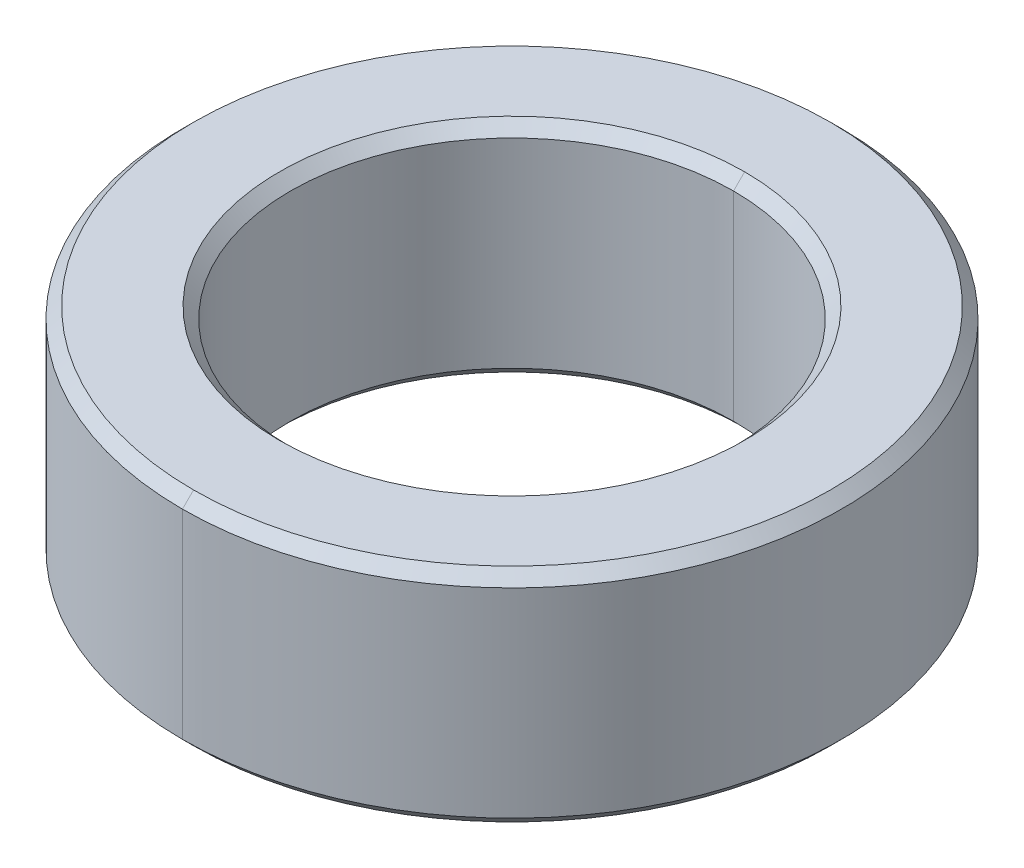
ISO-10303-21;
HEADER;
FILE_DESCRIPTION(('STEP AP214'),'2;1');
FILE_NAME('part.step','',(''),(''),'','','');
FILE_SCHEMA(('AUTOMOTIVE_DESIGN { 1 0 10303 214 1 1 1 1 }'));
ENDSEC;
DATA;
#1=APPLICATION_CONTEXT('core data for automotive mechanical design processes');
#2=APPLICATION_PROTOCOL_DEFINITION('international standard','automotive_design',2000,#1);
#3=PRODUCT_CONTEXT('',#1,'mechanical');
#4=PRODUCT('Part','Part','',(#3));
#5=PRODUCT_RELATED_PRODUCT_CATEGORY('part','',(#4));
#6=PRODUCT_DEFINITION_FORMATION('','',#4);
#7=PRODUCT_DEFINITION_CONTEXT('part definition',#1,'design');
#8=PRODUCT_DEFINITION('design','',#6,#7);
#9=PRODUCT_DEFINITION_SHAPE('','',#8);
#10=(LENGTH_UNIT() NAMED_UNIT(*) SI_UNIT(.MILLI.,.METRE.));
#11=(NAMED_UNIT(*) PLANE_ANGLE_UNIT() SI_UNIT($,.RADIAN.));
#12=(NAMED_UNIT(*) SI_UNIT($,.STERADIAN.) SOLID_ANGLE_UNIT());
#13=UNCERTAINTY_MEASURE_WITH_UNIT(LENGTH_MEASURE(1.E-05),#10,'distance_accuracy_value','');
#14=(GEOMETRIC_REPRESENTATION_CONTEXT(3) GLOBAL_UNCERTAINTY_ASSIGNED_CONTEXT((#13)) GLOBAL_UNIT_ASSIGNED_CONTEXT((#10,
#11,#12)) REPRESENTATION_CONTEXT('',''));
#15=CARTESIAN_POINT('',(0.,0.,0.));
#16=DIRECTION('',(0.,0.,1.));
#17=DIRECTION('',(1.,0.,0.));
#18=AXIS2_PLACEMENT_3D('',#15,#16,#17);
#19=CARTESIAN_POINT('',(0.,0.9,0.));
#20=DIRECTION('',(0.,1.,0.));
#21=DIRECTION('',(0.,0.,1.));
#22=AXIS2_PLACEMENT_3D('',#19,#20,#21);
#23=CONICAL_SURFACE('',#22,2.,0.785398163397459);
#24=CARTESIAN_POINT('',(0.,0.9,0.));
#25=DIRECTION('',(0.,1.,0.));
#26=DIRECTION('',(0.,0.,1.));
#27=AXIS2_PLACEMENT_3D('',#24,#25,#26);
#28=CIRCLE('',#27,2.);
#29=CARTESIAN_POINT('',(0.,0.9,-2.));
#30=VERTEX_POINT('',#29);
#31=CARTESIAN_POINT('',(0.,0.9,2.));
#32=VERTEX_POINT('',#31);
#33=EDGE_CURVE('E218',#30,#32,#28,.T.);
#34=ORIENTED_EDGE('',*,*,#33,.F.);
#35=DIRECTION('',(0.,0.70710678118654,-0.707106781186555));
#36=VECTOR('',#35,1.);
#37=CARTESIAN_POINT('',(0.,0.9,-2.));
#38=LINE('',#37,#36);
#39=CARTESIAN_POINT('',(0.,1.,-2.1));
#40=VERTEX_POINT('',#39);
#41=EDGE_CURVE('E11',#30,#40,#38,.T.);
#42=ORIENTED_EDGE('',*,*,#41,.T.);
#43=CARTESIAN_POINT('',(0.,1.,0.));
#44=DIRECTION('',(0.,-1.,0.));
#45=DIRECTION('',(0.,0.,1.));
#46=AXIS2_PLACEMENT_3D('',#43,#44,#45);
#47=CIRCLE('',#46,2.1);
#48=CARTESIAN_POINT('',(0.,1.,2.1));
#49=VERTEX_POINT('',#48);
#50=EDGE_CURVE('E167',#49,#40,#47,.T.);
#51=ORIENTED_EDGE('',*,*,#50,.F.);
#52=DIRECTION('',(0.,0.70710678118654,0.707106781186555));
#53=VECTOR('',#52,1.);
#54=CARTESIAN_POINT('',(0.,0.9,2.));
#55=LINE('',#54,#53);
#56=EDGE_CURVE('E124',#32,#49,#55,.T.);
#57=ORIENTED_EDGE('',*,*,#56,.F.);
#58=EDGE_LOOP('',(#34,#42,#51,#57));
#59=FACE_BOUND('',#58,.T.);
#60=ADVANCED_FACE('F16',(#59),#23,.F.);
#61=CARTESIAN_POINT('',(0.,-1.,0.));
#62=DIRECTION('',(0.,-1.,0.));
#63=DIRECTION('',(0.,0.,-1.));
#64=AXIS2_PLACEMENT_3D('',#61,#62,#63);
#65=CONICAL_SURFACE('',#64,2.1,0.785398163397448);
#66=CARTESIAN_POINT('',(0.,-0.9,0.));
#67=DIRECTION('',(0.,-1.,0.));
#68=DIRECTION('',(0.,0.,1.));
#69=AXIS2_PLACEMENT_3D('',#66,#67,#68);
#70=CIRCLE('',#69,2.);
#71=CARTESIAN_POINT('',(0.,-0.9,2.));
#72=VERTEX_POINT('',#71);
#73=CARTESIAN_POINT('',(0.,-0.9,-2.));
#74=VERTEX_POINT('',#73);
#75=EDGE_CURVE('E116',#72,#74,#70,.T.);
#76=ORIENTED_EDGE('',*,*,#75,.F.);
#77=DIRECTION('',(0.,-0.707106781186548,0.707106781186548));
#78=VECTOR('',#77,1.);
#79=CARTESIAN_POINT('',(0.,-1.,2.1));
#80=LINE('',#79,#78);
#81=CARTESIAN_POINT('',(0.,-1.,2.1));
#82=VERTEX_POINT('',#81);
#83=EDGE_CURVE('E27',#72,#82,#80,.T.);
#84=ORIENTED_EDGE('',*,*,#83,.T.);
#85=CARTESIAN_POINT('',(0.,-1.,0.));
#86=DIRECTION('',(0.,1.,0.));
#87=DIRECTION('',(0.,0.,1.));
#88=AXIS2_PLACEMENT_3D('',#85,#86,#87);
#89=CIRCLE('',#88,2.1);
#90=CARTESIAN_POINT('',(0.,-1.,-2.1));
#91=VERTEX_POINT('',#90);
#92=EDGE_CURVE('E118',#91,#82,#89,.T.);
#93=ORIENTED_EDGE('',*,*,#92,.F.);
#94=DIRECTION('',(0.,-0.707106781186548,-0.707106781186548));
#95=VECTOR('',#94,1.);
#96=CARTESIAN_POINT('',(0.,-1.,-2.1));
#97=LINE('',#96,#95);
#98=EDGE_CURVE('E113',#74,#91,#97,.T.);
#99=ORIENTED_EDGE('',*,*,#98,.F.);
#100=EDGE_LOOP('',(#76,#84,#93,#99));
#101=FACE_BOUND('',#100,.T.);
#102=ADVANCED_FACE('F114',(#101),#65,.F.);
#103=CARTESIAN_POINT('',(0.,1.,0.));
#104=DIRECTION('',(0.,-1.,0.));
#105=DIRECTION('',(0.,0.,-1.));
#106=AXIS2_PLACEMENT_3D('',#103,#104,#105);
#107=CONICAL_SURFACE('',#106,2.875,0.785398163397448);
#108=CARTESIAN_POINT('',(0.,1.,0.));
#109=DIRECTION('',(0.,1.,0.));
#110=DIRECTION('',(0.,0.,1.));
#111=AXIS2_PLACEMENT_3D('',#108,#109,#110);
#112=CIRCLE('',#111,2.875);
#113=CARTESIAN_POINT('',(0.,1.,2.875));
#114=VERTEX_POINT('',#113);
#115=CARTESIAN_POINT('',(0.,1.,-2.875));
#116=VERTEX_POINT('',#115);
#117=EDGE_CURVE('E195',#114,#116,#112,.T.);
#118=ORIENTED_EDGE('',*,*,#117,.F.);
#119=DIRECTION('',(0.,-0.707106781186548,0.707106781186548));
#120=VECTOR('',#119,1.);
#121=CARTESIAN_POINT('',(0.,1.,2.875));
#122=LINE('',#121,#120);
#123=CARTESIAN_POINT('',(0.,0.9,2.975));
#124=VERTEX_POINT('',#123);
#125=EDGE_CURVE('E180',#114,#124,#122,.T.);
#126=ORIENTED_EDGE('',*,*,#125,.T.);
#127=CARTESIAN_POINT('',(0.,0.9,0.));
#128=DIRECTION('',(0.,-1.,0.));
#129=DIRECTION('',(0.,0.,1.));
#130=AXIS2_PLACEMENT_3D('',#127,#128,#129);
#131=CIRCLE('',#130,2.975);
#132=CARTESIAN_POINT('',(0.,0.9,-2.975));
#133=VERTEX_POINT('',#132);
#134=EDGE_CURVE('E139',#133,#124,#131,.T.);
#135=ORIENTED_EDGE('',*,*,#134,.F.);
#136=DIRECTION('',(0.,-0.707106781186548,-0.707106781186548));
#137=VECTOR('',#136,1.);
#138=CARTESIAN_POINT('',(0.,1.,-2.875));
#139=LINE('',#138,#137);
#140=EDGE_CURVE('E77',#116,#133,#139,.T.);
#141=ORIENTED_EDGE('',*,*,#140,.F.);
#142=EDGE_LOOP('',(#118,#126,#135,#141));
#143=FACE_BOUND('',#142,.T.);
#144=ADVANCED_FACE('F194',(#143),#107,.T.);
#145=CARTESIAN_POINT('',(0.,-0.9,0.));
#146=DIRECTION('',(0.,1.,0.));
#147=DIRECTION('',(0.,0.,1.));
#148=AXIS2_PLACEMENT_3D('',#145,#146,#147);
#149=CONICAL_SURFACE('',#148,2.975,0.785398163397453);
#150=CARTESIAN_POINT('',(0.,-1.,0.));
#151=DIRECTION('',(0.,-1.,0.));
#152=DIRECTION('',(0.,0.,1.));
#153=AXIS2_PLACEMENT_3D('',#150,#151,#152);
#154=CIRCLE('',#153,2.875);
#155=CARTESIAN_POINT('',(0.,-1.,-2.875));
#156=VERTEX_POINT('',#155);
#157=CARTESIAN_POINT('',(0.,-1.,2.875));
#158=VERTEX_POINT('',#157);
#159=EDGE_CURVE('E223',#156,#158,#154,.T.);
#160=ORIENTED_EDGE('',*,*,#159,.F.);
#161=DIRECTION('',(0.,0.707106781186544,-0.707106781186551));
#162=VECTOR('',#161,1.);
#163=CARTESIAN_POINT('',(0.,-0.9,-2.975));
#164=LINE('',#163,#162);
#165=CARTESIAN_POINT('',(0.,-0.9,-2.975));
#166=VERTEX_POINT('',#165);
#167=EDGE_CURVE('E184',#156,#166,#164,.T.);
#168=ORIENTED_EDGE('',*,*,#167,.T.);
#169=CARTESIAN_POINT('',(0.,-0.9,0.));
#170=DIRECTION('',(0.,1.,0.));
#171=DIRECTION('',(0.,0.,1.));
#172=AXIS2_PLACEMENT_3D('',#169,#170,#171);
#173=CIRCLE('',#172,2.975);
#174=CARTESIAN_POINT('',(0.,-0.9,2.975));
#175=VERTEX_POINT('',#174);
#176=EDGE_CURVE('E172',#175,#166,#173,.T.);
#177=ORIENTED_EDGE('',*,*,#176,.F.);
#178=DIRECTION('',(0.,0.707106781186544,0.707106781186551));
#179=VECTOR('',#178,1.);
#180=CARTESIAN_POINT('',(0.,-0.9,2.975));
#181=LINE('',#180,#179);
#182=EDGE_CURVE('E143',#158,#175,#181,.T.);
#183=ORIENTED_EDGE('',*,*,#182,.F.);
#184=EDGE_LOOP('',(#160,#168,#177,#183));
#185=FACE_BOUND('',#184,.T.);
#186=ADVANCED_FACE('F245',(#185),#149,.T.);
#187=CARTESIAN_POINT('',(0.,1.,0.));
#188=DIRECTION('',(0.,-1.,0.));
#189=DIRECTION('',(0.,0.,-1.));
#190=AXIS2_PLACEMENT_3D('',#187,#188,#189);
#191=CYLINDRICAL_SURFACE('',#190,2.);
#192=ORIENTED_EDGE('',*,*,#33,.T.);
#193=DIRECTION('',(0.,-1.,0.));
#194=VECTOR('',#193,1.);
#195=CARTESIAN_POINT('',(0.,1.,2.));
#196=LINE('',#195,#194);
#197=EDGE_CURVE('E136',#32,#72,#196,.T.);
#198=ORIENTED_EDGE('',*,*,#197,.T.);
#199=ORIENTED_EDGE('',*,*,#75,.T.);
#200=DIRECTION('',(0.,-1.,0.));
#201=VECTOR('',#200,1.);
#202=CARTESIAN_POINT('',(0.,1.,-2.));
#203=LINE('',#202,#201);
#204=EDGE_CURVE('E42',#30,#74,#203,.T.);
#205=ORIENTED_EDGE('',*,*,#204,.F.);
#206=EDGE_LOOP('',(#192,#198,#199,#205));
#207=FACE_BOUND('',#206,.T.);
#208=ADVANCED_FACE('F135',(#207),#191,.F.);
#209=CARTESIAN_POINT('',(0.,1.,0.));
#210=DIRECTION('',(0.,-1.,0.));
#211=DIRECTION('',(0.,0.,-1.));
#212=AXIS2_PLACEMENT_3D('',#209,#210,#211);
#213=CYLINDRICAL_SURFACE('',#212,2.975);
#214=ORIENTED_EDGE('',*,*,#134,.T.);
#215=DIRECTION('',(0.,-1.,0.));
#216=VECTOR('',#215,1.);
#217=CARTESIAN_POINT('',(0.,1.,2.975));
#218=LINE('',#217,#216);
#219=EDGE_CURVE('E169',#124,#175,#218,.T.);
#220=ORIENTED_EDGE('',*,*,#219,.T.);
#221=ORIENTED_EDGE('',*,*,#176,.T.);
#222=DIRECTION('',(0.,-1.,0.));
#223=VECTOR('',#222,1.);
#224=CARTESIAN_POINT('',(0.,1.,-2.975));
#225=LINE('',#224,#223);
#226=EDGE_CURVE('E179',#133,#166,#225,.T.);
#227=ORIENTED_EDGE('',*,*,#226,.F.);
#228=EDGE_LOOP('',(#214,#220,#221,#227));
#229=FACE_BOUND('',#228,.T.);
#230=ADVANCED_FACE('F190',(#229),#213,.T.);
#231=CARTESIAN_POINT('',(0.,1.,0.));
#232=DIRECTION('',(0.,1.,0.));
#233=DIRECTION('',(1.,0.,0.));
#234=AXIS2_PLACEMENT_3D('',#231,#232,#233);
#235=PLANE('',#234);
#236=CARTESIAN_POINT('',(0.,1.,0.));
#237=DIRECTION('',(0.,1.,0.));
#238=DIRECTION('',(0.,0.,1.));
#239=AXIS2_PLACEMENT_3D('',#236,#237,#238);
#240=CIRCLE('',#239,2.875);
#241=EDGE_CURVE('E215',#116,#114,#240,.T.);
#242=ORIENTED_EDGE('',*,*,#241,.T.);
#243=ORIENTED_EDGE('',*,*,#117,.T.);
#244=EDGE_LOOP('',(#242,#243));
#245=FACE_BOUND('',#244,.T.);
#246=ORIENTED_EDGE('',*,*,#50,.T.);
#247=CARTESIAN_POINT('',(0.,1.,0.));
#248=DIRECTION('',(0.,-1.,0.));
#249=DIRECTION('',(0.,0.,1.));
#250=AXIS2_PLACEMENT_3D('',#247,#248,#249);
#251=CIRCLE('',#250,2.1);
#252=EDGE_CURVE('E164',#40,#49,#251,.T.);
#253=ORIENTED_EDGE('',*,*,#252,.T.);
#254=EDGE_LOOP('',(#246,#253));
#255=FACE_BOUND('',#254,.T.);
#256=ADVANCED_FACE('F265',(#245,#255),#235,.T.);
#257=CARTESIAN_POINT('',(0.,-1.,0.));
#258=DIRECTION('',(0.,1.,0.));
#259=DIRECTION('',(1.,0.,0.));
#260=AXIS2_PLACEMENT_3D('',#257,#258,#259);
#261=PLANE('',#260);
#262=CARTESIAN_POINT('',(0.,-1.,0.));
#263=DIRECTION('',(0.,-1.,0.));
#264=DIRECTION('',(0.,0.,1.));
#265=AXIS2_PLACEMENT_3D('',#262,#263,#264);
#266=CIRCLE('',#265,2.875);
#267=EDGE_CURVE('E168',#158,#156,#266,.T.);
#268=ORIENTED_EDGE('',*,*,#267,.T.);
#269=ORIENTED_EDGE('',*,*,#159,.T.);
#270=EDGE_LOOP('',(#268,#269));
#271=FACE_BOUND('',#270,.T.);
#272=ORIENTED_EDGE('',*,*,#92,.T.);
#273=CARTESIAN_POINT('',(0.,-1.,0.));
#274=DIRECTION('',(0.,1.,0.));
#275=DIRECTION('',(0.,0.,1.));
#276=AXIS2_PLACEMENT_3D('',#273,#274,#275);
#277=CIRCLE('',#276,2.1);
#278=EDGE_CURVE('E178',#82,#91,#277,.T.);
#279=ORIENTED_EDGE('',*,*,#278,.T.);
#280=EDGE_LOOP('',(#272,#279));
#281=FACE_BOUND('',#280,.T.);
#282=ADVANCED_FACE('F18',(#271,#281),#261,.F.);
#283=CARTESIAN_POINT('',(0.,1.,0.));
#284=DIRECTION('',(0.,-1.,0.));
#285=DIRECTION('',(0.,0.,-1.));
#286=AXIS2_PLACEMENT_3D('',#283,#284,#285);
#287=CYLINDRICAL_SURFACE('',#286,2.975);
#288=ORIENTED_EDGE('',*,*,#219,.F.);
#289=CARTESIAN_POINT('',(0.,0.9,0.));
#290=DIRECTION('',(0.,-1.,0.));
#291=DIRECTION('',(0.,0.,1.));
#292=AXIS2_PLACEMENT_3D('',#289,#290,#291);
#293=CIRCLE('',#292,2.975);
#294=EDGE_CURVE('E174',#124,#133,#293,.T.);
#295=ORIENTED_EDGE('',*,*,#294,.T.);
#296=ORIENTED_EDGE('',*,*,#226,.T.);
#297=CARTESIAN_POINT('',(0.,-0.9,0.));
#298=DIRECTION('',(0.,1.,0.));
#299=DIRECTION('',(0.,0.,1.));
#300=AXIS2_PLACEMENT_3D('',#297,#298,#299);
#301=CIRCLE('',#300,2.975);
#302=EDGE_CURVE('E200',#166,#175,#301,.T.);
#303=ORIENTED_EDGE('',*,*,#302,.T.);
#304=EDGE_LOOP('',(#288,#295,#296,#303));
#305=FACE_BOUND('',#304,.T.);
#306=ADVANCED_FACE('F199',(#305),#287,.T.);
#307=CARTESIAN_POINT('',(0.,1.,0.));
#308=DIRECTION('',(0.,-1.,0.));
#309=DIRECTION('',(0.,0.,-1.));
#310=AXIS2_PLACEMENT_3D('',#307,#308,#309);
#311=CYLINDRICAL_SURFACE('',#310,2.);
#312=ORIENTED_EDGE('',*,*,#197,.F.);
#313=CARTESIAN_POINT('',(0.,0.9,0.));
#314=DIRECTION('',(0.,1.,0.));
#315=DIRECTION('',(0.,0.,1.));
#316=AXIS2_PLACEMENT_3D('',#313,#314,#315);
#317=CIRCLE('',#316,2.);
#318=EDGE_CURVE('E132',#32,#30,#317,.T.);
#319=ORIENTED_EDGE('',*,*,#318,.T.);
#320=ORIENTED_EDGE('',*,*,#204,.T.);
#321=CARTESIAN_POINT('',(0.,-0.9,0.));
#322=DIRECTION('',(0.,-1.,0.));
#323=DIRECTION('',(0.,0.,1.));
#324=AXIS2_PLACEMENT_3D('',#321,#322,#323);
#325=CIRCLE('',#324,2.);
#326=EDGE_CURVE('E20',#74,#72,#325,.T.);
#327=ORIENTED_EDGE('',*,*,#326,.T.);
#328=EDGE_LOOP('',(#312,#319,#320,#327));
#329=FACE_BOUND('',#328,.T.);
#330=ADVANCED_FACE('F130',(#329),#311,.F.);
#331=CARTESIAN_POINT('',(0.,-0.9,0.));
#332=DIRECTION('',(0.,1.,0.));
#333=DIRECTION('',(0.,0.,1.));
#334=AXIS2_PLACEMENT_3D('',#331,#332,#333);
#335=CONICAL_SURFACE('',#334,2.975,0.785398163397453);
#336=ORIENTED_EDGE('',*,*,#167,.F.);
#337=ORIENTED_EDGE('',*,*,#267,.F.);
#338=ORIENTED_EDGE('',*,*,#182,.T.);
#339=ORIENTED_EDGE('',*,*,#302,.F.);
#340=EDGE_LOOP('',(#336,#337,#338,#339));
#341=FACE_BOUND('',#340,.T.);
#342=ADVANCED_FACE('F241',(#341),#335,.T.);
#343=CARTESIAN_POINT('',(0.,1.,0.));
#344=DIRECTION('',(0.,-1.,0.));
#345=DIRECTION('',(0.,0.,-1.));
#346=AXIS2_PLACEMENT_3D('',#343,#344,#345);
#347=CONICAL_SURFACE('',#346,2.875,0.785398163397448);
#348=ORIENTED_EDGE('',*,*,#125,.F.);
#349=ORIENTED_EDGE('',*,*,#241,.F.);
#350=ORIENTED_EDGE('',*,*,#140,.T.);
#351=ORIENTED_EDGE('',*,*,#294,.F.);
#352=EDGE_LOOP('',(#348,#349,#350,#351));
#353=FACE_BOUND('',#352,.T.);
#354=ADVANCED_FACE('F197',(#353),#347,.T.);
#355=CARTESIAN_POINT('',(0.,-1.,0.));
#356=DIRECTION('',(0.,-1.,0.));
#357=DIRECTION('',(0.,0.,-1.));
#358=AXIS2_PLACEMENT_3D('',#355,#356,#357);
#359=CONICAL_SURFACE('',#358,2.1,0.785398163397448);
#360=ORIENTED_EDGE('',*,*,#83,.F.);
#361=ORIENTED_EDGE('',*,*,#326,.F.);
#362=ORIENTED_EDGE('',*,*,#98,.T.);
#363=ORIENTED_EDGE('',*,*,#278,.F.);
#364=EDGE_LOOP('',(#360,#361,#362,#363));
#365=FACE_BOUND('',#364,.T.);
#366=ADVANCED_FACE('F141',(#365),#359,.F.);
#367=CARTESIAN_POINT('',(0.,0.9,0.));
#368=DIRECTION('',(0.,1.,0.));
#369=DIRECTION('',(0.,0.,1.));
#370=AXIS2_PLACEMENT_3D('',#367,#368,#369);
#371=CONICAL_SURFACE('',#370,2.,0.785398163397459);
#372=ORIENTED_EDGE('',*,*,#41,.F.);
#373=ORIENTED_EDGE('',*,*,#318,.F.);
#374=ORIENTED_EDGE('',*,*,#56,.T.);
#375=ORIENTED_EDGE('',*,*,#252,.F.);
#376=EDGE_LOOP('',(#372,#373,#374,#375));
#377=FACE_BOUND('',#376,.T.);
#378=ADVANCED_FACE('F287',(#377),#371,.F.);
#379=CLOSED_SHELL('',(#60,#102,#144,#186,#208,#230,#256,#282,#306,#330,#342,#354,#366,#378));
#380=MANIFOLD_SOLID_BREP('B1',#379);
#381=ADVANCED_BREP_SHAPE_REPRESENTATION('',(#18,#380),#14);
#382=SHAPE_DEFINITION_REPRESENTATION(#9,#381);
ENDSEC;
END-ISO-10303-21;
